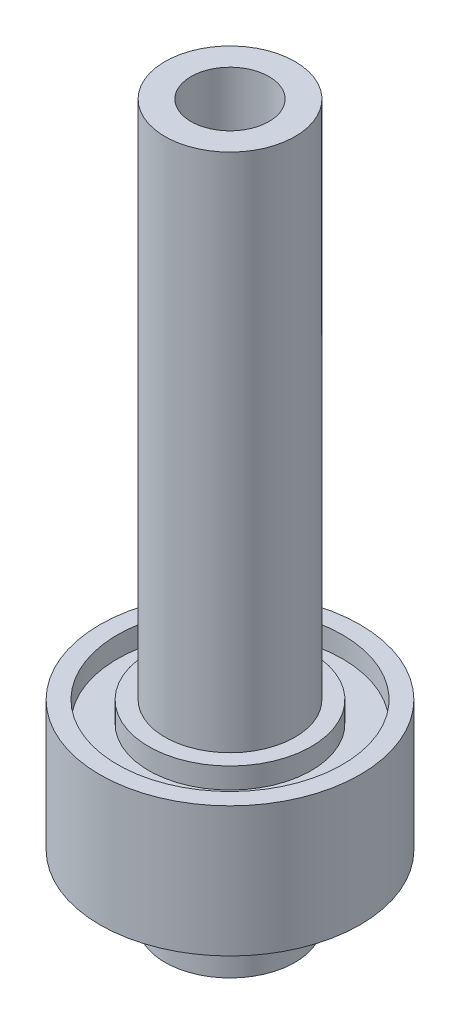
ISO-10303-21;
HEADER;
FILE_DESCRIPTION(('STEP AP214'),'2;1');
FILE_NAME('part.step','',(''),(''),'','','');
FILE_SCHEMA(('AUTOMOTIVE_DESIGN { 1 0 10303 214 1 1 1 1 }'));
ENDSEC;
DATA;
#1=APPLICATION_CONTEXT('core data for automotive mechanical design processes');
#2=APPLICATION_PROTOCOL_DEFINITION('international standard','automotive_design',2000,#1);
#3=PRODUCT_CONTEXT('',#1,'mechanical');
#4=PRODUCT('Part','Part','',(#3));
#5=PRODUCT_RELATED_PRODUCT_CATEGORY('part','',(#4));
#6=PRODUCT_DEFINITION_FORMATION('','',#4);
#7=PRODUCT_DEFINITION_CONTEXT('part definition',#1,'design');
#8=PRODUCT_DEFINITION('design','',#6,#7);
#9=PRODUCT_DEFINITION_SHAPE('','',#8);
#10=(LENGTH_UNIT() NAMED_UNIT(*) SI_UNIT(.MILLI.,.METRE.));
#11=(NAMED_UNIT(*) PLANE_ANGLE_UNIT() SI_UNIT($,.RADIAN.));
#12=(NAMED_UNIT(*) SI_UNIT($,.STERADIAN.) SOLID_ANGLE_UNIT());
#13=UNCERTAINTY_MEASURE_WITH_UNIT(LENGTH_MEASURE(1.E-05),#10,'distance_accuracy_value','');
#14=(GEOMETRIC_REPRESENTATION_CONTEXT(3) GLOBAL_UNCERTAINTY_ASSIGNED_CONTEXT((#13)) GLOBAL_UNIT_ASSIGNED_CONTEXT((#10,
#11,#12)) REPRESENTATION_CONTEXT('',''));
#15=CARTESIAN_POINT('',(0.,0.,0.));
#16=DIRECTION('',(0.,0.,1.));
#17=DIRECTION('',(1.,0.,0.));
#18=AXIS2_PLACEMENT_3D('',#15,#16,#17);
#19=CARTESIAN_POINT('',(0.,0.,0.));
#20=DIRECTION('',(0.,-1.,0.));
#21=DIRECTION('',(0.,0.,-1.));
#22=AXIS2_PLACEMENT_3D('',#19,#20,#21);
#23=CYLINDRICAL_SURFACE('',#22,3.81);
#24=CARTESIAN_POINT('',(0.,69.85,0.));
#25=DIRECTION('',(0.,-1.,0.));
#26=DIRECTION('',(0.,0.,-1.));
#27=AXIS2_PLACEMENT_3D('',#24,#25,#26);
#28=CIRCLE('',#27,3.81000000000001);
#29=CARTESIAN_POINT('',(0.,69.85,-3.81000000000001));
#30=VERTEX_POINT('',#29);
#31=EDGE_CURVE('E104',#30,#30,#28,.T.);
#32=ORIENTED_EDGE('',*,*,#31,.F.);
#33=EDGE_LOOP('',(#32));
#34=FACE_BOUND('',#33,.T.);
#35=CARTESIAN_POINT('',(0.,0.,0.));
#36=DIRECTION('',(0.,-1.,0.));
#37=DIRECTION('',(0.,0.,-1.));
#38=AXIS2_PLACEMENT_3D('',#35,#36,#37);
#39=CIRCLE('',#38,3.81);
#40=CARTESIAN_POINT('',(0.,0.,-3.81));
#41=VERTEX_POINT('',#40);
#42=EDGE_CURVE('E10',#41,#41,#39,.T.);
#43=ORIENTED_EDGE('',*,*,#42,.T.);
#44=EDGE_LOOP('',(#43));
#45=FACE_BOUND('',#44,.T.);
#46=ADVANCED_FACE('F37',(#34,#45),#23,.F.);
#47=CARTESIAN_POINT('',(-3.81,0.,0.));
#48=DIRECTION('',(0.,1.,0.));
#49=DIRECTION('',(0.,0.,1.));
#50=AXIS2_PLACEMENT_3D('',#47,#48,#49);
#51=PLANE('',#50);
#52=ORIENTED_EDGE('',*,*,#42,.F.);
#53=EDGE_LOOP('',(#52));
#54=FACE_BOUND('',#53,.T.);
#55=CARTESIAN_POINT('',(0.,0.,0.));
#56=DIRECTION('',(0.,-1.,0.));
#57=DIRECTION('',(0.,0.,-1.));
#58=AXIS2_PLACEMENT_3D('',#55,#56,#57);
#59=CIRCLE('',#58,6.35);
#60=CARTESIAN_POINT('',(0.,0.,-6.35));
#61=VERTEX_POINT('',#60);
#62=EDGE_CURVE('E44',#61,#61,#59,.T.);
#63=ORIENTED_EDGE('',*,*,#62,.T.);
#64=EDGE_LOOP('',(#63));
#65=FACE_BOUND('',#64,.T.);
#66=ADVANCED_FACE('F112',(#54,#65),#51,.F.);
#67=CARTESIAN_POINT('',(0.,0.,0.));
#68=DIRECTION('',(0.,-1.,0.));
#69=DIRECTION('',(0.,0.,-1.));
#70=AXIS2_PLACEMENT_3D('',#67,#68,#69);
#71=CYLINDRICAL_SURFACE('',#70,6.35);
#72=ORIENTED_EDGE('',*,*,#62,.F.);
#73=EDGE_LOOP('',(#72));
#74=FACE_BOUND('',#73,.T.);
#75=CARTESIAN_POINT('',(0.,6.35,0.));
#76=DIRECTION('',(0.,-1.,0.));
#77=DIRECTION('',(0.,0.,-1.));
#78=AXIS2_PLACEMENT_3D('',#75,#76,#77);
#79=CIRCLE('',#78,6.35);
#80=CARTESIAN_POINT('',(0.,6.35,-6.35));
#81=VERTEX_POINT('',#80);
#82=EDGE_CURVE('E49',#81,#81,#79,.T.);
#83=ORIENTED_EDGE('',*,*,#82,.T.);
#84=EDGE_LOOP('',(#83));
#85=FACE_BOUND('',#84,.T.);
#86=ADVANCED_FACE('F116',(#74,#85),#71,.T.);
#87=CARTESIAN_POINT('',(-6.35,6.35,0.));
#88=DIRECTION('',(0.,1.,0.));
#89=DIRECTION('',(0.,0.,1.));
#90=AXIS2_PLACEMENT_3D('',#87,#88,#89);
#91=PLANE('',#90);
#92=ORIENTED_EDGE('',*,*,#82,.F.);
#93=EDGE_LOOP('',(#92));
#94=FACE_BOUND('',#93,.T.);
#95=CARTESIAN_POINT('',(0.,6.35,0.));
#96=DIRECTION('',(0.,-1.,0.));
#97=DIRECTION('',(0.,0.,-1.));
#98=AXIS2_PLACEMENT_3D('',#95,#96,#97);
#99=CIRCLE('',#98,7.9375);
#100=CARTESIAN_POINT('',(0.,6.35,-7.9375));
#101=VERTEX_POINT('',#100);
#102=EDGE_CURVE('E54',#101,#101,#99,.T.);
#103=ORIENTED_EDGE('',*,*,#102,.T.);
#104=EDGE_LOOP('',(#103));
#105=FACE_BOUND('',#104,.T.);
#106=ADVANCED_FACE('F121',(#94,#105),#91,.F.);
#107=CARTESIAN_POINT('',(0.,0.,0.));
#108=DIRECTION('',(0.,-1.,0.));
#109=DIRECTION('',(0.,0.,-1.));
#110=AXIS2_PLACEMENT_3D('',#107,#108,#109);
#111=CYLINDRICAL_SURFACE('',#110,7.9375);
#112=ORIENTED_EDGE('',*,*,#102,.F.);
#113=EDGE_LOOP('',(#112));
#114=FACE_BOUND('',#113,.T.);
#115=CARTESIAN_POINT('',(0.,8.382,0.));
#116=DIRECTION('',(0.,-1.,0.));
#117=DIRECTION('',(0.,0.,-1.));
#118=AXIS2_PLACEMENT_3D('',#115,#116,#117);
#119=CIRCLE('',#118,7.9375);
#120=CARTESIAN_POINT('',(0.,8.382,-7.9375));
#121=VERTEX_POINT('',#120);
#122=EDGE_CURVE('E60',#121,#121,#119,.T.);
#123=ORIENTED_EDGE('',*,*,#122,.T.);
#124=EDGE_LOOP('',(#123));
#125=FACE_BOUND('',#124,.T.);
#126=ADVANCED_FACE('F127',(#114,#125),#111,.T.);
#127=CARTESIAN_POINT('',(-7.9375,8.382,0.));
#128=DIRECTION('',(0.,1.,0.));
#129=DIRECTION('',(0.,0.,1.));
#130=AXIS2_PLACEMENT_3D('',#127,#128,#129);
#131=PLANE('',#130);
#132=ORIENTED_EDGE('',*,*,#122,.F.);
#133=EDGE_LOOP('',(#132));
#134=FACE_BOUND('',#133,.T.);
#135=CARTESIAN_POINT('',(0.,8.382,0.));
#136=DIRECTION('',(0.,-1.,0.));
#137=DIRECTION('',(0.,0.,-1.));
#138=AXIS2_PLACEMENT_3D('',#135,#136,#137);
#139=CIRCLE('',#138,10.9855);
#140=CARTESIAN_POINT('',(0.,8.382,-10.9855));
#141=VERTEX_POINT('',#140);
#142=EDGE_CURVE('E64',#141,#141,#139,.T.);
#143=ORIENTED_EDGE('',*,*,#142,.T.);
#144=EDGE_LOOP('',(#143));
#145=FACE_BOUND('',#144,.T.);
#146=ADVANCED_FACE('F131',(#134,#145),#131,.F.);
#147=CARTESIAN_POINT('',(0.,0.,0.));
#148=DIRECTION('',(0.,-1.,0.));
#149=DIRECTION('',(0.,0.,-1.));
#150=AXIS2_PLACEMENT_3D('',#147,#148,#149);
#151=CYLINDRICAL_SURFACE('',#150,10.9855);
#152=ORIENTED_EDGE('',*,*,#142,.F.);
#153=EDGE_LOOP('',(#152));
#154=FACE_BOUND('',#153,.T.);
#155=CARTESIAN_POINT('',(0.,6.35,0.));
#156=DIRECTION('',(0.,-1.,0.));
#157=DIRECTION('',(0.,0.,-1.));
#158=AXIS2_PLACEMENT_3D('',#155,#156,#157);
#159=CIRCLE('',#158,10.9855);
#160=CARTESIAN_POINT('',(0.,6.35,-10.9855));
#161=VERTEX_POINT('',#160);
#162=EDGE_CURVE('E68',#161,#161,#159,.T.);
#163=ORIENTED_EDGE('',*,*,#162,.T.);
#164=EDGE_LOOP('',(#163));
#165=FACE_BOUND('',#164,.T.);
#166=ADVANCED_FACE('F135',(#154,#165),#151,.F.);
#167=CARTESIAN_POINT('',(-10.9855,6.35,0.));
#168=DIRECTION('',(0.,1.,0.));
#169=DIRECTION('',(0.,0.,1.));
#170=AXIS2_PLACEMENT_3D('',#167,#168,#169);
#171=PLANE('',#170);
#172=ORIENTED_EDGE('',*,*,#162,.F.);
#173=EDGE_LOOP('',(#172));
#174=FACE_BOUND('',#173,.T.);
#175=CARTESIAN_POINT('',(0.,6.35,0.));
#176=DIRECTION('',(0.,-1.,0.));
#177=DIRECTION('',(0.,0.,-1.));
#178=AXIS2_PLACEMENT_3D('',#175,#176,#177);
#179=CIRCLE('',#178,12.7);
#180=CARTESIAN_POINT('',(0.,6.35,-12.7));
#181=VERTEX_POINT('',#180);
#182=EDGE_CURVE('E72',#181,#181,#179,.T.);
#183=ORIENTED_EDGE('',*,*,#182,.T.);
#184=EDGE_LOOP('',(#183));
#185=FACE_BOUND('',#184,.T.);
#186=ADVANCED_FACE('F139',(#174,#185),#171,.F.);
#187=CARTESIAN_POINT('',(0.,0.,0.));
#188=DIRECTION('',(0.,-1.,0.));
#189=DIRECTION('',(0.,0.,-1.));
#190=AXIS2_PLACEMENT_3D('',#187,#188,#189);
#191=CYLINDRICAL_SURFACE('',#190,12.7);
#192=ORIENTED_EDGE('',*,*,#182,.F.);
#193=EDGE_LOOP('',(#192));
#194=FACE_BOUND('',#193,.T.);
#195=CARTESIAN_POINT('',(0.,19.05,0.));
#196=DIRECTION('',(0.,-1.,0.));
#197=DIRECTION('',(0.,0.,-1.));
#198=AXIS2_PLACEMENT_3D('',#195,#196,#197);
#199=CIRCLE('',#198,12.7);
#200=CARTESIAN_POINT('',(0.,19.05,-12.7));
#201=VERTEX_POINT('',#200);
#202=EDGE_CURVE('E76',#201,#201,#199,.T.);
#203=ORIENTED_EDGE('',*,*,#202,.T.);
#204=EDGE_LOOP('',(#203));
#205=FACE_BOUND('',#204,.T.);
#206=ADVANCED_FACE('F143',(#194,#205),#191,.T.);
#207=CARTESIAN_POINT('',(-12.7,19.05,0.));
#208=DIRECTION('',(0.,-1.,0.));
#209=DIRECTION('',(0.,0.,-1.));
#210=AXIS2_PLACEMENT_3D('',#207,#208,#209);
#211=PLANE('',#210);
#212=ORIENTED_EDGE('',*,*,#202,.F.);
#213=EDGE_LOOP('',(#212));
#214=FACE_BOUND('',#213,.T.);
#215=CARTESIAN_POINT('',(0.,19.05,0.));
#216=DIRECTION('',(0.,-1.,0.));
#217=DIRECTION('',(0.,0.,-1.));
#218=AXIS2_PLACEMENT_3D('',#215,#216,#217);
#219=CIRCLE('',#218,10.9855);
#220=CARTESIAN_POINT('',(0.,19.05,-10.9855));
#221=VERTEX_POINT('',#220);
#222=EDGE_CURVE('E80',#221,#221,#219,.T.);
#223=ORIENTED_EDGE('',*,*,#222,.T.);
#224=EDGE_LOOP('',(#223));
#225=FACE_BOUND('',#224,.T.);
#226=ADVANCED_FACE('F147',(#214,#225),#211,.F.);
#227=CARTESIAN_POINT('',(0.,0.,0.));
#228=DIRECTION('',(0.,-1.,0.));
#229=DIRECTION('',(0.,0.,-1.));
#230=AXIS2_PLACEMENT_3D('',#227,#228,#229);
#231=CYLINDRICAL_SURFACE('',#230,10.9855);
#232=ORIENTED_EDGE('',*,*,#222,.F.);
#233=EDGE_LOOP('',(#232));
#234=FACE_BOUND('',#233,.T.);
#235=CARTESIAN_POINT('',(0.,17.018,0.));
#236=DIRECTION('',(0.,-1.,0.));
#237=DIRECTION('',(0.,0.,-1.));
#238=AXIS2_PLACEMENT_3D('',#235,#236,#237);
#239=CIRCLE('',#238,10.9855);
#240=CARTESIAN_POINT('',(0.,17.018,-10.9855));
#241=VERTEX_POINT('',#240);
#242=EDGE_CURVE('E84',#241,#241,#239,.T.);
#243=ORIENTED_EDGE('',*,*,#242,.T.);
#244=EDGE_LOOP('',(#243));
#245=FACE_BOUND('',#244,.T.);
#246=ADVANCED_FACE('F151',(#234,#245),#231,.F.);
#247=CARTESIAN_POINT('',(-10.9855,17.018,0.));
#248=DIRECTION('',(0.,-1.,0.));
#249=DIRECTION('',(0.,0.,-1.));
#250=AXIS2_PLACEMENT_3D('',#247,#248,#249);
#251=PLANE('',#250);
#252=ORIENTED_EDGE('',*,*,#242,.F.);
#253=EDGE_LOOP('',(#252));
#254=FACE_BOUND('',#253,.T.);
#255=CARTESIAN_POINT('',(0.,17.018,0.));
#256=DIRECTION('',(0.,-1.,0.));
#257=DIRECTION('',(0.,0.,-1.));
#258=AXIS2_PLACEMENT_3D('',#255,#256,#257);
#259=CIRCLE('',#258,7.9375);
#260=CARTESIAN_POINT('',(0.,17.018,-7.9375));
#261=VERTEX_POINT('',#260);
#262=EDGE_CURVE('E88',#261,#261,#259,.T.);
#263=ORIENTED_EDGE('',*,*,#262,.T.);
#264=EDGE_LOOP('',(#263));
#265=FACE_BOUND('',#264,.T.);
#266=ADVANCED_FACE('F155',(#254,#265),#251,.F.);
#267=CARTESIAN_POINT('',(0.,0.,0.));
#268=DIRECTION('',(0.,-1.,0.));
#269=DIRECTION('',(0.,0.,-1.));
#270=AXIS2_PLACEMENT_3D('',#267,#268,#269);
#271=CYLINDRICAL_SURFACE('',#270,7.9375);
#272=ORIENTED_EDGE('',*,*,#262,.F.);
#273=EDGE_LOOP('',(#272));
#274=FACE_BOUND('',#273,.T.);
#275=CARTESIAN_POINT('',(0.,19.05,0.));
#276=DIRECTION('',(0.,-1.,0.));
#277=DIRECTION('',(0.,0.,-1.));
#278=AXIS2_PLACEMENT_3D('',#275,#276,#277);
#279=CIRCLE('',#278,7.9375);
#280=CARTESIAN_POINT('',(0.,19.05,-7.9375));
#281=VERTEX_POINT('',#280);
#282=EDGE_CURVE('E92',#281,#281,#279,.T.);
#283=ORIENTED_EDGE('',*,*,#282,.T.);
#284=EDGE_LOOP('',(#283));
#285=FACE_BOUND('',#284,.T.);
#286=ADVANCED_FACE('F159',(#274,#285),#271,.T.);
#287=CARTESIAN_POINT('',(-7.9375,19.05,0.));
#288=DIRECTION('',(0.,-1.,0.));
#289=DIRECTION('',(0.,0.,-1.));
#290=AXIS2_PLACEMENT_3D('',#287,#288,#289);
#291=PLANE('',#290);
#292=ORIENTED_EDGE('',*,*,#282,.F.);
#293=EDGE_LOOP('',(#292));
#294=FACE_BOUND('',#293,.T.);
#295=CARTESIAN_POINT('',(0.,19.05,0.));
#296=DIRECTION('',(0.,-1.,0.));
#297=DIRECTION('',(0.,0.,-1.));
#298=AXIS2_PLACEMENT_3D('',#295,#296,#297);
#299=CIRCLE('',#298,6.35);
#300=CARTESIAN_POINT('',(0.,19.05,-6.35));
#301=VERTEX_POINT('',#300);
#302=EDGE_CURVE('E96',#301,#301,#299,.T.);
#303=ORIENTED_EDGE('',*,*,#302,.T.);
#304=EDGE_LOOP('',(#303));
#305=FACE_BOUND('',#304,.T.);
#306=ADVANCED_FACE('F163',(#294,#305),#291,.F.);
#307=CARTESIAN_POINT('',(0.,0.,0.));
#308=DIRECTION('',(0.,-1.,0.));
#309=DIRECTION('',(0.,0.,-1.));
#310=AXIS2_PLACEMENT_3D('',#307,#308,#309);
#311=CYLINDRICAL_SURFACE('',#310,6.35);
#312=ORIENTED_EDGE('',*,*,#302,.F.);
#313=EDGE_LOOP('',(#312));
#314=FACE_BOUND('',#313,.T.);
#315=CARTESIAN_POINT('',(0.,69.85,0.));
#316=DIRECTION('',(0.,-1.,0.));
#317=DIRECTION('',(0.,0.,-1.));
#318=AXIS2_PLACEMENT_3D('',#315,#316,#317);
#319=CIRCLE('',#318,6.35);
#320=CARTESIAN_POINT('',(0.,69.85,-6.35));
#321=VERTEX_POINT('',#320);
#322=EDGE_CURVE('E100',#321,#321,#319,.T.);
#323=ORIENTED_EDGE('',*,*,#322,.T.);
#324=EDGE_LOOP('',(#323));
#325=FACE_BOUND('',#324,.T.);
#326=ADVANCED_FACE('F167',(#314,#325),#311,.T.);
#327=CARTESIAN_POINT('',(-6.35,69.85,0.));
#328=DIRECTION('',(0.,-1.,0.));
#329=DIRECTION('',(0.,0.,-1.));
#330=AXIS2_PLACEMENT_3D('',#327,#328,#329);
#331=PLANE('',#330);
#332=ORIENTED_EDGE('',*,*,#322,.F.);
#333=EDGE_LOOP('',(#332));
#334=FACE_BOUND('',#333,.T.);
#335=ORIENTED_EDGE('',*,*,#31,.T.);
#336=EDGE_LOOP('',(#335));
#337=FACE_BOUND('',#336,.T.);
#338=ADVANCED_FACE('F109',(#334,#337),#331,.F.);
#339=CLOSED_SHELL('',(#46,#66,#86,#106,#126,#146,#166,#186,#206,#226,#246,#266,#286,#306,#326,#338));
#340=MANIFOLD_SOLID_BREP('B2',#339);
#341=ADVANCED_BREP_SHAPE_REPRESENTATION('',(#18,#340),#14);
#342=SHAPE_DEFINITION_REPRESENTATION(#9,#341);
ENDSEC;
END-ISO-10303-21;
